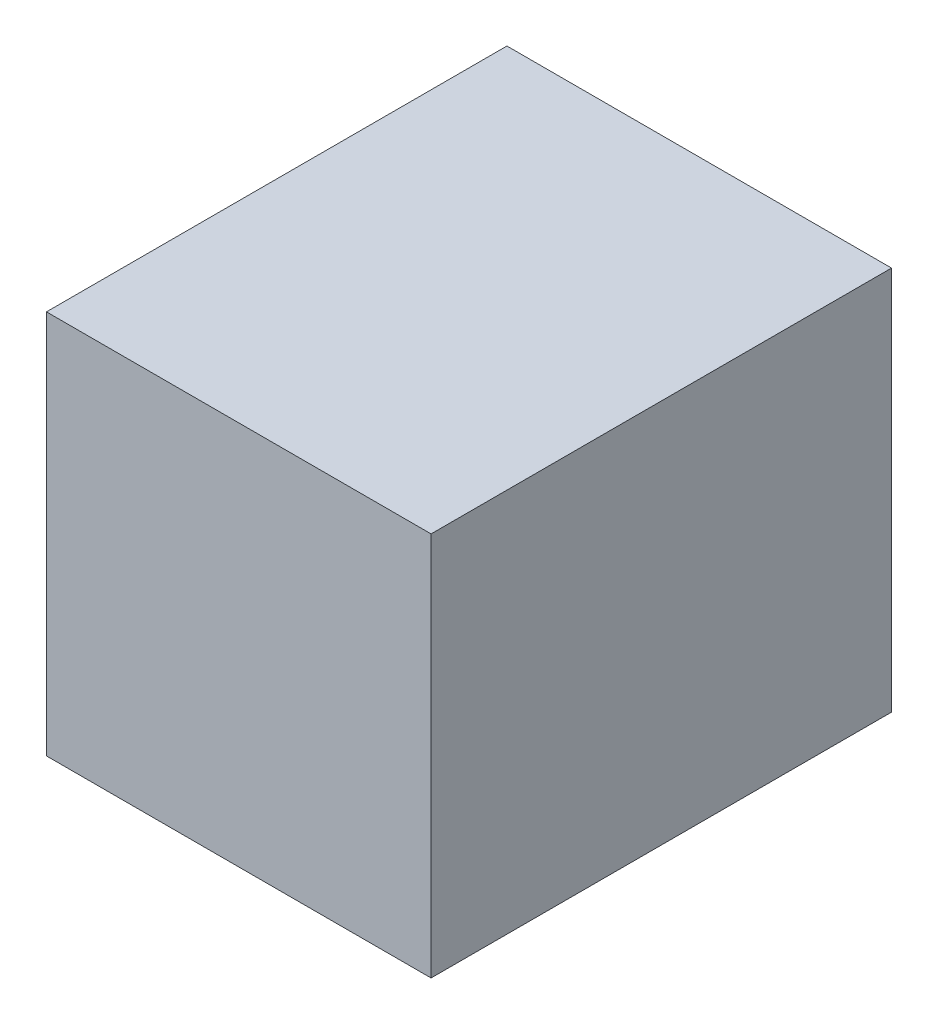
ISO-10303-21;
HEADER;
FILE_DESCRIPTION(('STEP AP214'),'2;1');
FILE_NAME('part.step','',(''),(''),'','','');
FILE_SCHEMA(('AUTOMOTIVE_DESIGN { 1 0 10303 214 1 1 1 1 }'));
ENDSEC;
DATA;
#1=APPLICATION_CONTEXT('core data for automotive mechanical design processes');
#2=APPLICATION_PROTOCOL_DEFINITION('international standard','automotive_design',2000,#1);
#3=PRODUCT_CONTEXT('',#1,'mechanical');
#4=PRODUCT('Part','Part','',(#3));
#5=PRODUCT_RELATED_PRODUCT_CATEGORY('part','',(#4));
#6=PRODUCT_DEFINITION_FORMATION('','',#4);
#7=PRODUCT_DEFINITION_CONTEXT('part definition',#1,'design');
#8=PRODUCT_DEFINITION('design','',#6,#7);
#9=PRODUCT_DEFINITION_SHAPE('','',#8);
#10=(LENGTH_UNIT() NAMED_UNIT(*) SI_UNIT(.MILLI.,.METRE.));
#11=(NAMED_UNIT(*) PLANE_ANGLE_UNIT() SI_UNIT($,.RADIAN.));
#12=(NAMED_UNIT(*) SI_UNIT($,.STERADIAN.) SOLID_ANGLE_UNIT());
#13=UNCERTAINTY_MEASURE_WITH_UNIT(LENGTH_MEASURE(1.E-05),#10,'distance_accuracy_value','');
#14=(GEOMETRIC_REPRESENTATION_CONTEXT(3) GLOBAL_UNCERTAINTY_ASSIGNED_CONTEXT((#13)) GLOBAL_UNIT_ASSIGNED_CONTEXT((#10,
#11,#12)) REPRESENTATION_CONTEXT('',''));
#15=CARTESIAN_POINT('',(0.,0.,0.));
#16=DIRECTION('',(0.,0.,1.));
#17=DIRECTION('',(1.,0.,0.));
#18=AXIS2_PLACEMENT_3D('',#15,#16,#17);
#19=CARTESIAN_POINT('',(66.8215908221288,-66.8215908221287,160.));
#20=DIRECTION('',(-1.,0.,0.));
#21=DIRECTION('',(0.,-1.,0.));
#22=AXIS2_PLACEMENT_3D('',#19,#20,#21);
#23=PLANE('',#22);
#24=DIRECTION('',(0.,1.,0.));
#25=VECTOR('',#24,1.);
#26=CARTESIAN_POINT('',(66.8215908221288,-66.8215908221287,0.));
#27=LINE('',#26,#25);
#28=CARTESIAN_POINT('',(66.8215908221288,-66.8215908221287,0.));
#29=VERTEX_POINT('',#28);
#30=CARTESIAN_POINT('',(66.8215908221287,66.8215908221288,0.));
#31=VERTEX_POINT('',#30);
#32=EDGE_CURVE('E96',#29,#31,#27,.T.);
#33=ORIENTED_EDGE('',*,*,#32,.T.);
#34=DIRECTION('',(0.,0.,-1.));
#35=VECTOR('',#34,1.);
#36=CARTESIAN_POINT('',(66.8215908221287,66.8215908221288,160.));
#37=LINE('',#36,#35);
#38=CARTESIAN_POINT('',(66.8215908221287,66.8215908221288,160.));
#39=VERTEX_POINT('',#38);
#40=EDGE_CURVE('E11',#39,#31,#37,.T.);
#41=ORIENTED_EDGE('',*,*,#40,.F.);
#42=DIRECTION('',(0.,1.,0.));
#43=VECTOR('',#42,1.);
#44=CARTESIAN_POINT('',(66.8215908221288,-66.8215908221287,160.));
#45=LINE('',#44,#43);
#46=CARTESIAN_POINT('',(66.8215908221288,-66.8215908221287,160.));
#47=VERTEX_POINT('',#46);
#48=EDGE_CURVE('E84',#47,#39,#45,.T.);
#49=ORIENTED_EDGE('',*,*,#48,.F.);
#50=DIRECTION('',(0.,0.,-1.));
#51=VECTOR('',#50,1.);
#52=CARTESIAN_POINT('',(66.8215908221288,-66.8215908221287,160.));
#53=LINE('',#52,#51);
#54=EDGE_CURVE('E92',#47,#29,#53,.T.);
#55=ORIENTED_EDGE('',*,*,#54,.T.);
#56=EDGE_LOOP('',(#33,#41,#49,#55));
#57=FACE_BOUND('',#56,.T.);
#58=ADVANCED_FACE('F33',(#57),#23,.F.);
#59=CARTESIAN_POINT('',(66.8215908221287,66.8215908221288,160.));
#60=DIRECTION('',(0.,-1.,0.));
#61=DIRECTION('',(1.,0.,0.));
#62=AXIS2_PLACEMENT_3D('',#59,#60,#61);
#63=PLANE('',#62);
#64=DIRECTION('',(-1.,0.,0.));
#65=VECTOR('',#64,1.);
#66=CARTESIAN_POINT('',(66.8215908221287,66.8215908221288,0.));
#67=LINE('',#66,#65);
#68=CARTESIAN_POINT('',(-66.8215908221287,66.8215908221287,0.));
#69=VERTEX_POINT('',#68);
#70=EDGE_CURVE('E88',#31,#69,#67,.T.);
#71=ORIENTED_EDGE('',*,*,#70,.T.);
#72=DIRECTION('',(0.,0.,-1.));
#73=VECTOR('',#72,1.);
#74=CARTESIAN_POINT('',(-66.8215908221287,66.8215908221287,160.));
#75=LINE('',#74,#73);
#76=CARTESIAN_POINT('',(-66.8215908221287,66.8215908221287,160.));
#77=VERTEX_POINT('',#76);
#78=EDGE_CURVE('E41',#77,#69,#75,.T.);
#79=ORIENTED_EDGE('',*,*,#78,.F.);
#80=DIRECTION('',(-1.,0.,0.));
#81=VECTOR('',#80,1.);
#82=CARTESIAN_POINT('',(66.8215908221287,66.8215908221288,160.));
#83=LINE('',#82,#81);
#84=EDGE_CURVE('E79',#39,#77,#83,.T.);
#85=ORIENTED_EDGE('',*,*,#84,.F.);
#86=ORIENTED_EDGE('',*,*,#40,.T.);
#87=EDGE_LOOP('',(#71,#79,#85,#86));
#88=FACE_BOUND('',#87,.T.);
#89=ADVANCED_FACE('F87',(#88),#63,.F.);
#90=CARTESIAN_POINT('',(-66.8215908221287,66.8215908221287,160.));
#91=DIRECTION('',(1.,0.,0.));
#92=DIRECTION('',(0.,1.,0.));
#93=AXIS2_PLACEMENT_3D('',#90,#91,#92);
#94=PLANE('',#93);
#95=DIRECTION('',(0.,-1.,0.));
#96=VECTOR('',#95,1.);
#97=CARTESIAN_POINT('',(-66.8215908221287,66.8215908221287,0.));
#98=LINE('',#97,#96);
#99=CARTESIAN_POINT('',(-66.8215908221287,-66.8215908221287,0.));
#100=VERTEX_POINT('',#99);
#101=EDGE_CURVE('E66',#69,#100,#98,.T.);
#102=ORIENTED_EDGE('',*,*,#101,.T.);
#103=DIRECTION('',(0.,0.,-1.));
#104=VECTOR('',#103,1.);
#105=CARTESIAN_POINT('',(-66.8215908221287,-66.8215908221287,160.));
#106=LINE('',#105,#104);
#107=CARTESIAN_POINT('',(-66.8215908221287,-66.8215908221287,160.));
#108=VERTEX_POINT('',#107);
#109=EDGE_CURVE('E89',#108,#100,#106,.T.);
#110=ORIENTED_EDGE('',*,*,#109,.F.);
#111=DIRECTION('',(0.,-1.,0.));
#112=VECTOR('',#111,1.);
#113=CARTESIAN_POINT('',(-66.8215908221287,66.8215908221287,160.));
#114=LINE('',#113,#112);
#115=EDGE_CURVE('E82',#77,#108,#114,.T.);
#116=ORIENTED_EDGE('',*,*,#115,.F.);
#117=ORIENTED_EDGE('',*,*,#78,.T.);
#118=EDGE_LOOP('',(#102,#110,#116,#117));
#119=FACE_BOUND('',#118,.T.);
#120=ADVANCED_FACE('F90',(#119),#94,.F.);
#121=CARTESIAN_POINT('',(-66.8215908221287,-66.8215908221287,160.));
#122=DIRECTION('',(0.,1.,0.));
#123=DIRECTION('',(0.,0.,1.));
#124=AXIS2_PLACEMENT_3D('',#121,#122,#123);
#125=PLANE('',#124);
#126=DIRECTION('',(1.,0.,0.));
#127=VECTOR('',#126,1.);
#128=CARTESIAN_POINT('',(-66.8215908221287,-66.8215908221287,0.));
#129=LINE('',#128,#127);
#130=EDGE_CURVE('E72',#100,#29,#129,.T.);
#131=ORIENTED_EDGE('',*,*,#130,.T.);
#132=ORIENTED_EDGE('',*,*,#54,.F.);
#133=DIRECTION('',(1.,0.,0.));
#134=VECTOR('',#133,1.);
#135=CARTESIAN_POINT('',(-66.8215908221287,-66.8215908221287,160.));
#136=LINE('',#135,#134);
#137=EDGE_CURVE('E49',#108,#47,#136,.T.);
#138=ORIENTED_EDGE('',*,*,#137,.F.);
#139=ORIENTED_EDGE('',*,*,#109,.T.);
#140=EDGE_LOOP('',(#131,#132,#138,#139));
#141=FACE_BOUND('',#140,.T.);
#142=ADVANCED_FACE('F103',(#141),#125,.F.);
#143=CARTESIAN_POINT('',(0.,0.,160.));
#144=DIRECTION('',(0.,0.,1.));
#145=DIRECTION('',(1.,0.,0.));
#146=AXIS2_PLACEMENT_3D('',#143,#144,#145);
#147=PLANE('',#146);
#148=ORIENTED_EDGE('',*,*,#48,.T.);
#149=ORIENTED_EDGE('',*,*,#84,.T.);
#150=ORIENTED_EDGE('',*,*,#115,.T.);
#151=ORIENTED_EDGE('',*,*,#137,.T.);
#152=EDGE_LOOP('',(#148,#149,#150,#151));
#153=FACE_BOUND('',#152,.T.);
#154=ADVANCED_FACE('F80',(#153),#147,.T.);
#155=CARTESIAN_POINT('',(0.,0.,0.));
#156=DIRECTION('',(0.,0.,1.));
#157=DIRECTION('',(1.,0.,0.));
#158=AXIS2_PLACEMENT_3D('',#155,#156,#157);
#159=PLANE('',#158);
#160=ORIENTED_EDGE('',*,*,#32,.F.);
#161=ORIENTED_EDGE('',*,*,#130,.F.);
#162=ORIENTED_EDGE('',*,*,#101,.F.);
#163=ORIENTED_EDGE('',*,*,#70,.F.);
#164=EDGE_LOOP('',(#160,#161,#162,#163));
#165=FACE_BOUND('',#164,.T.);
#166=ADVANCED_FACE('F106',(#165),#159,.F.);
#167=CLOSED_SHELL('',(#58,#89,#120,#142,#154,#166));
#168=MANIFOLD_SOLID_BREP('B2',#167);
#169=ADVANCED_BREP_SHAPE_REPRESENTATION('',(#18,#168),#14);
#170=SHAPE_DEFINITION_REPRESENTATION(#9,#169);
ENDSEC;
END-ISO-10303-21;
